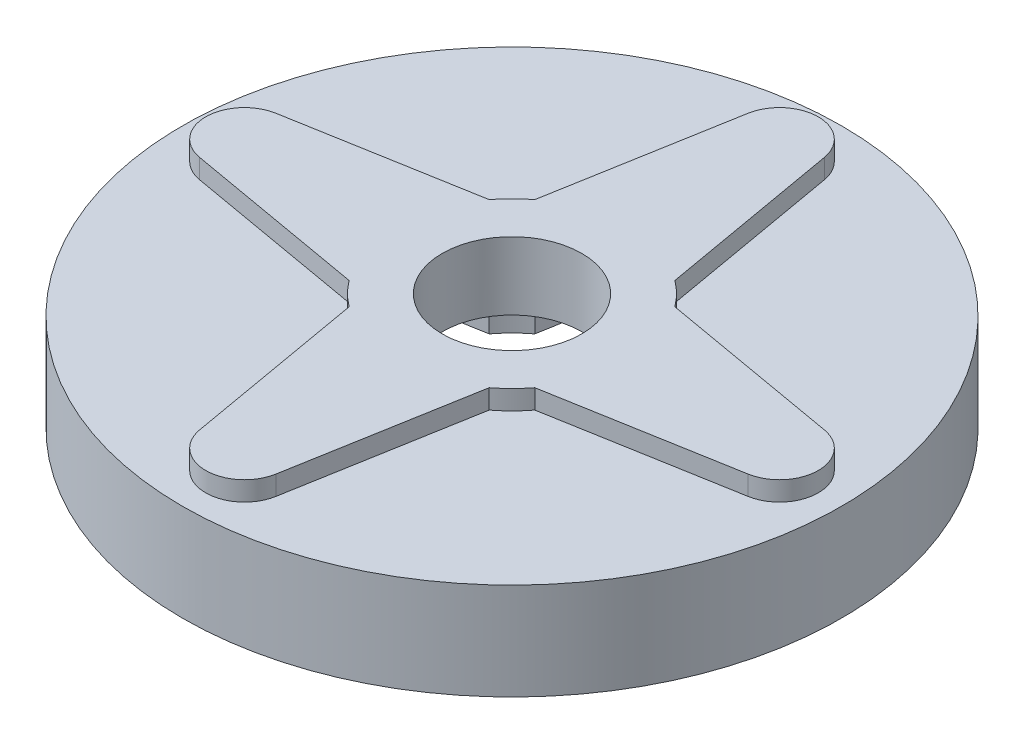
ISO-10303-21;
HEADER;
FILE_DESCRIPTION(('STEP AP214'),'2;1');
FILE_NAME('part.step','',(''),(''),'','','');
FILE_SCHEMA(('AUTOMOTIVE_DESIGN { 1 0 10303 214 1 1 1 1 }'));
ENDSEC;
DATA;
#1=APPLICATION_CONTEXT('core data for automotive mechanical design processes');
#2=APPLICATION_PROTOCOL_DEFINITION('international standard','automotive_design',2000,#1);
#3=PRODUCT_CONTEXT('',#1,'mechanical');
#4=PRODUCT('Part','Part','',(#3));
#5=PRODUCT_RELATED_PRODUCT_CATEGORY('part','',(#4));
#6=PRODUCT_DEFINITION_FORMATION('','',#4);
#7=PRODUCT_DEFINITION_CONTEXT('part definition',#1,'design');
#8=PRODUCT_DEFINITION('design','',#6,#7);
#9=PRODUCT_DEFINITION_SHAPE('','',#8);
#10=(LENGTH_UNIT() NAMED_UNIT(*) SI_UNIT(.MILLI.,.METRE.));
#11=(NAMED_UNIT(*) PLANE_ANGLE_UNIT() SI_UNIT($,.RADIAN.));
#12=(NAMED_UNIT(*) SI_UNIT($,.STERADIAN.) SOLID_ANGLE_UNIT());
#13=UNCERTAINTY_MEASURE_WITH_UNIT(LENGTH_MEASURE(1.E-05),#10,'distance_accuracy_value','');
#14=(GEOMETRIC_REPRESENTATION_CONTEXT(3) GLOBAL_UNCERTAINTY_ASSIGNED_CONTEXT((#13)) GLOBAL_UNIT_ASSIGNED_CONTEXT((#10,
#11,#12)) REPRESENTATION_CONTEXT('',''));
#15=CARTESIAN_POINT('',(0.,0.,0.));
#16=DIRECTION('',(0.,0.,1.));
#17=DIRECTION('',(1.,0.,0.));
#18=AXIS2_PLACEMENT_3D('',#15,#16,#17);
#19=CARTESIAN_POINT('',(0.,0.,0.));
#20=DIRECTION('',(0.,1.,0.));
#21=DIRECTION('',(0.,0.,1.));
#22=AXIS2_PLACEMENT_3D('',#19,#20,#21);
#23=PLANE('',#22);
#24=CARTESIAN_POINT('',(0.,0.,0.));
#25=DIRECTION('',(0.,1.,0.));
#26=DIRECTION('',(0.,0.,1.));
#27=AXIS2_PLACEMENT_3D('',#24,#25,#26);
#28=CIRCLE('',#27,21.59);
#29=CARTESIAN_POINT('',(0.,0.,21.59));
#30=VERTEX_POINT('',#29);
#31=EDGE_CURVE('E38',#30,#30,#28,.T.);
#32=ORIENTED_EDGE('',*,*,#31,.F.);
#33=EDGE_LOOP('',(#32));
#34=FACE_BOUND('',#33,.T.);
#35=DIRECTION('',(-0.172920710694254,0.,0.98493574806329));
#36=VECTOR('',#35,1.);
#37=CARTESIAN_POINT('',(-5.48669132761631,0.,-0.963273559312847));
#38=LINE('',#37,#36);
#39=CARTESIAN_POINT('',(-2.50173680008076,0.,-17.9652186051634));
#40=VERTEX_POINT('',#39);
#41=CARTESIAN_POINT('',(-4.58762464598258,0.,-6.08425016806288));
#42=VERTEX_POINT('',#41);
#43=EDGE_CURVE('E57',#40,#42,#38,.T.);
#44=ORIENTED_EDGE('',*,*,#43,.T.);
#45=CARTESIAN_POINT('',(0.,0.,0.));
#46=DIRECTION('',(0.,-1.,0.));
#47=DIRECTION('',(0.,0.,-1.));
#48=AXIS2_PLACEMENT_3D('',#45,#46,#47);
#49=CIRCLE('',#48,7.62);
#50=CARTESIAN_POINT('',(-6.08425016806289,0.,-4.58762464598257));
#51=VERTEX_POINT('',#50);
#52=EDGE_CURVE('E373',#51,#42,#49,.T.);
#53=ORIENTED_EDGE('',*,*,#52,.F.);
#54=DIRECTION('',(-0.98493574806329,0.,0.172920710694255));
#55=VECTOR('',#54,1.);
#56=CARTESIAN_POINT('',(-0.963273559312881,0.,-5.48669132761631));
#57=LINE('',#56,#55);
#58=CARTESIAN_POINT('',(-17.9652186051634,0.,-2.50173680008077));
#59=VERTEX_POINT('',#58);
#60=EDGE_CURVE('E445',#51,#59,#57,.T.);
#61=ORIENTED_EDGE('',*,*,#60,.T.);
#62=CARTESIAN_POINT('',(-17.526,0.,0.));
#63=DIRECTION('',(0.,-1.,0.));
#64=DIRECTION('',(0.,0.,-1.));
#65=AXIS2_PLACEMENT_3D('',#62,#63,#64);
#66=CIRCLE('',#65,2.54);
#67=CARTESIAN_POINT('',(-17.9652186051634,0.,2.50173680008076));
#68=VERTEX_POINT('',#67);
#69=EDGE_CURVE('E442',#68,#59,#66,.T.);
#70=ORIENTED_EDGE('',*,*,#69,.F.);
#71=DIRECTION('',(0.98493574806329,0.,0.172920710694255));
#72=VECTOR('',#71,1.);
#73=CARTESIAN_POINT('',(-0.96327355931288,0.,5.48669132761632));
#74=LINE('',#73,#72);
#75=CARTESIAN_POINT('',(-6.08425016806289,0.,4.58762464598263));
#76=VERTEX_POINT('',#75);
#77=EDGE_CURVE('E439',#68,#76,#74,.T.);
#78=ORIENTED_EDGE('',*,*,#77,.T.);
#79=CARTESIAN_POINT('',(-4.58762464598258,0.,6.0842501680629));
#80=VERTEX_POINT('',#79);
#81=EDGE_CURVE('E438',#80,#76,#49,.T.);
#82=ORIENTED_EDGE('',*,*,#81,.F.);
#83=DIRECTION('',(0.172920710694255,0.,0.98493574806329));
#84=VECTOR('',#83,1.);
#85=CARTESIAN_POINT('',(-5.48669132761631,0.,0.963273559312874));
#86=LINE('',#85,#84);
#87=CARTESIAN_POINT('',(-2.50173680008076,0.,17.9652186051634));
#88=VERTEX_POINT('',#87);
#89=EDGE_CURVE('E435',#80,#88,#86,.T.);
#90=ORIENTED_EDGE('',*,*,#89,.T.);
#91=CARTESIAN_POINT('',(0.,0.,17.526));
#92=DIRECTION('',(0.,-1.,0.));
#93=DIRECTION('',(0.,0.,-1.));
#94=AXIS2_PLACEMENT_3D('',#91,#92,#93);
#95=CIRCLE('',#94,2.54000000000001);
#96=CARTESIAN_POINT('',(2.50173680008076,0.,17.9652186051634));
#97=VERTEX_POINT('',#96);
#98=EDGE_CURVE('E432',#97,#88,#95,.T.);
#99=ORIENTED_EDGE('',*,*,#98,.F.);
#100=DIRECTION('',(0.172920710694254,0.,-0.98493574806329));
#101=VECTOR('',#100,1.);
#102=CARTESIAN_POINT('',(5.48669132761631,0.,0.963273559312874));
#103=LINE('',#102,#101);
#104=CARTESIAN_POINT('',(4.58762464598257,0.,6.08425016806292));
#105=VERTEX_POINT('',#104);
#106=EDGE_CURVE('E429',#97,#105,#103,.T.);
#107=ORIENTED_EDGE('',*,*,#106,.T.);
#108=CARTESIAN_POINT('',(6.08425016806289,0.,4.58762464598252));
#109=VERTEX_POINT('',#108);
#110=EDGE_CURVE('E420',#109,#105,#49,.T.);
#111=ORIENTED_EDGE('',*,*,#110,.F.);
#112=DIRECTION('',(0.984935748063291,0.,-0.172920710694254));
#113=VECTOR('',#112,1.);
#114=CARTESIAN_POINT('',(0.963273559312871,0.,5.48669132761632));
#115=LINE('',#114,#113);
#116=CARTESIAN_POINT('',(17.9652186051634,0.,2.50173680008076));
#117=VERTEX_POINT('',#116);
#118=EDGE_CURVE('E426',#109,#117,#115,.T.);
#119=ORIENTED_EDGE('',*,*,#118,.T.);
#120=CARTESIAN_POINT('',(17.526,0.,0.));
#121=DIRECTION('',(0.,-1.,0.));
#122=DIRECTION('',(0.,0.,-1.));
#123=AXIS2_PLACEMENT_3D('',#120,#121,#122);
#124=CIRCLE('',#123,2.54);
#125=CARTESIAN_POINT('',(17.9652186051634,0.,-2.50173680008076));
#126=VERTEX_POINT('',#125);
#127=EDGE_CURVE('E423',#126,#117,#124,.T.);
#128=ORIENTED_EDGE('',*,*,#127,.F.);
#129=DIRECTION('',(-0.984935748063291,0.,-0.172920710694254));
#130=VECTOR('',#129,1.);
#131=CARTESIAN_POINT('',(0.963273559312869,0.,-5.48669132761628));
#132=LINE('',#131,#130);
#133=CARTESIAN_POINT('',(6.08425016806289,0.,-4.58762464598257));
#134=VERTEX_POINT('',#133);
#135=EDGE_CURVE('E419',#126,#134,#132,.T.);
#136=ORIENTED_EDGE('',*,*,#135,.T.);
#137=CARTESIAN_POINT('',(4.58762464598257,0.,-6.08425016806287));
#138=VERTEX_POINT('',#137);
#139=EDGE_CURVE('E416',#138,#134,#49,.T.);
#140=ORIENTED_EDGE('',*,*,#139,.F.);
#141=DIRECTION('',(-0.172920710694255,0.,-0.98493574806329));
#142=VECTOR('',#141,1.);
#143=CARTESIAN_POINT('',(5.48669132761631,0.,-0.963273559312902));
#144=LINE('',#143,#142);
#145=CARTESIAN_POINT('',(2.50173680008076,0.,-17.9652186051634));
#146=VERTEX_POINT('',#145);
#147=EDGE_CURVE('E413',#138,#146,#144,.T.);
#148=ORIENTED_EDGE('',*,*,#147,.T.);
#149=CARTESIAN_POINT('',(0.,0.,-17.526));
#150=DIRECTION('',(0.,-1.,0.));
#151=DIRECTION('',(0.,0.,-1.));
#152=AXIS2_PLACEMENT_3D('',#149,#150,#151);
#153=CIRCLE('',#152,2.54);
#154=EDGE_CURVE('E410',#40,#146,#153,.T.);
#155=ORIENTED_EDGE('',*,*,#154,.F.);
#156=EDGE_LOOP('',(#44,#53,#61,#70,#78,#82,#90,#99,#107,#111,#119,#128,#136,#140,#148,#155));
#157=FACE_BOUND('',#156,.T.);
#158=ADVANCED_FACE('F34',(#34,#157),#23,.F.);
#159=CARTESIAN_POINT('',(0.,6.35,0.));
#160=DIRECTION('',(0.,-1.,0.));
#161=DIRECTION('',(0.,0.,-1.));
#162=AXIS2_PLACEMENT_3D('',#159,#160,#161);
#163=CYLINDRICAL_SURFACE('',#162,4.572);
#164=CARTESIAN_POINT('',(0.,3.175,0.));
#165=DIRECTION('',(0.,-1.,0.));
#166=DIRECTION('',(0.,0.,-1.));
#167=AXIS2_PLACEMENT_3D('',#164,#165,#166);
#168=CIRCLE('',#167,4.572);
#169=CARTESIAN_POINT('',(0.,3.175,-4.572));
#170=VERTEX_POINT('',#169);
#171=EDGE_CURVE('E405',#170,#170,#168,.F.);
#172=ORIENTED_EDGE('',*,*,#171,.F.);
#173=EDGE_LOOP('',(#172));
#174=FACE_BOUND('',#173,.T.);
#175=CARTESIAN_POINT('',(0.,7.62,0.));
#176=DIRECTION('',(0.,1.,0.));
#177=DIRECTION('',(0.,0.,1.));
#178=AXIS2_PLACEMENT_3D('',#175,#176,#177);
#179=CIRCLE('',#178,4.572);
#180=CARTESIAN_POINT('',(0.,7.62,4.572));
#181=VERTEX_POINT('',#180);
#182=EDGE_CURVE('E305',#181,#181,#179,.F.);
#183=ORIENTED_EDGE('',*,*,#182,.F.);
#184=EDGE_LOOP('',(#183));
#185=FACE_BOUND('',#184,.T.);
#186=ADVANCED_FACE('F554',(#174,#185),#163,.F.);
#187=CARTESIAN_POINT('',(0.,6.35,0.));
#188=DIRECTION('',(0.,-1.,0.));
#189=DIRECTION('',(0.,0.,-1.));
#190=AXIS2_PLACEMENT_3D('',#187,#188,#189);
#191=CYLINDRICAL_SURFACE('',#190,21.59);
#192=CARTESIAN_POINT('',(0.,6.35,0.));
#193=DIRECTION('',(0.,1.,0.));
#194=DIRECTION('',(0.,0.,1.));
#195=AXIS2_PLACEMENT_3D('',#192,#193,#194);
#196=CIRCLE('',#195,21.59);
#197=CARTESIAN_POINT('',(0.,6.35,21.59));
#198=VERTEX_POINT('',#197);
#199=EDGE_CURVE('E11',#198,#198,#196,.T.);
#200=ORIENTED_EDGE('',*,*,#199,.F.);
#201=EDGE_LOOP('',(#200));
#202=FACE_BOUND('',#201,.T.);
#203=ORIENTED_EDGE('',*,*,#31,.T.);
#204=EDGE_LOOP('',(#203));
#205=FACE_BOUND('',#204,.T.);
#206=ADVANCED_FACE('F36',(#202,#205),#191,.T.);
#207=CARTESIAN_POINT('',(0.,6.35,0.));
#208=DIRECTION('',(0.,1.,0.));
#209=DIRECTION('',(0.,0.,1.));
#210=AXIS2_PLACEMENT_3D('',#207,#208,#209);
#211=PLANE('',#210);
#212=DIRECTION('',(0.172920710694256,0.,0.98493574806329));
#213=VECTOR('',#212,1.);
#214=CARTESIAN_POINT('',(5.48669132761631,6.35,-0.963273559312902));
#215=LINE('',#214,#213);
#216=CARTESIAN_POINT('',(2.50173680008076,6.35,-17.9652186051634));
#217=VERTEX_POINT('',#216);
#218=CARTESIAN_POINT('',(4.58762464598257,6.35,-6.08425016806287));
#219=VERTEX_POINT('',#218);
#220=EDGE_CURVE('E249',#217,#219,#215,.T.);
#221=ORIENTED_EDGE('',*,*,#220,.T.);
#222=CARTESIAN_POINT('',(0.,6.35,0.));
#223=DIRECTION('',(0.,1.,0.));
#224=DIRECTION('',(0.,0.,1.));
#225=AXIS2_PLACEMENT_3D('',#222,#223,#224);
#226=CIRCLE('',#225,7.62);
#227=CARTESIAN_POINT('',(6.08425016806289,6.35,-4.58762464598256));
#228=VERTEX_POINT('',#227);
#229=EDGE_CURVE('E269',#228,#219,#226,.T.);
#230=ORIENTED_EDGE('',*,*,#229,.F.);
#231=DIRECTION('',(0.984935748063291,0.,0.172920710694254));
#232=VECTOR('',#231,1.);
#233=CARTESIAN_POINT('',(0.963273559312869,6.35,-5.48669132761628));
#234=LINE('',#233,#232);
#235=CARTESIAN_POINT('',(17.9652186051634,6.35,-2.50173680008076));
#236=VERTEX_POINT('',#235);
#237=EDGE_CURVE('E49',#228,#236,#234,.T.);
#238=ORIENTED_EDGE('',*,*,#237,.T.);
#239=CARTESIAN_POINT('',(17.526,6.35,0.));
#240=DIRECTION('',(0.,1.,0.));
#241=DIRECTION('',(0.,0.,1.));
#242=AXIS2_PLACEMENT_3D('',#239,#240,#241);
#243=CIRCLE('',#242,2.54);
#244=CARTESIAN_POINT('',(17.9652186051634,6.35,2.50173680008076));
#245=VERTEX_POINT('',#244);
#246=EDGE_CURVE('E338',#245,#236,#243,.T.);
#247=ORIENTED_EDGE('',*,*,#246,.F.);
#248=DIRECTION('',(-0.984935748063291,0.,0.172920710694254));
#249=VECTOR('',#248,1.);
#250=CARTESIAN_POINT('',(0.963273559312869,6.35,5.48669132761632));
#251=LINE('',#250,#249);
#252=CARTESIAN_POINT('',(6.08425016806289,6.35,4.58762464598252));
#253=VERTEX_POINT('',#252);
#254=EDGE_CURVE('E335',#245,#253,#251,.T.);
#255=ORIENTED_EDGE('',*,*,#254,.T.);
#256=CARTESIAN_POINT('',(4.58762464598257,6.35,6.08425016806292));
#257=VERTEX_POINT('',#256);
#258=EDGE_CURVE('E273',#257,#253,#226,.T.);
#259=ORIENTED_EDGE('',*,*,#258,.F.);
#260=DIRECTION('',(-0.172920710694255,0.,0.98493574806329));
#261=VECTOR('',#260,1.);
#262=CARTESIAN_POINT('',(5.48669132761631,6.35,0.963273559312888));
#263=LINE('',#262,#261);
#264=CARTESIAN_POINT('',(2.50173680008076,6.35,17.9652186051634));
#265=VERTEX_POINT('',#264);
#266=EDGE_CURVE('E332',#257,#265,#263,.T.);
#267=ORIENTED_EDGE('',*,*,#266,.T.);
#268=CARTESIAN_POINT('',(0.,6.35,17.526));
#269=DIRECTION('',(0.,1.,0.));
#270=DIRECTION('',(0.,0.,1.));
#271=AXIS2_PLACEMENT_3D('',#268,#269,#270);
#272=CIRCLE('',#271,2.54000000000001);
#273=CARTESIAN_POINT('',(-2.50173680008076,6.35,17.9652186051634));
#274=VERTEX_POINT('',#273);
#275=EDGE_CURVE('E329',#274,#265,#272,.T.);
#276=ORIENTED_EDGE('',*,*,#275,.F.);
#277=DIRECTION('',(-0.172920710694256,0.,-0.98493574806329));
#278=VECTOR('',#277,1.);
#279=CARTESIAN_POINT('',(-5.48669132761632,6.35,0.963273559312861));
#280=LINE('',#279,#278);
#281=CARTESIAN_POINT('',(-4.58762464598257,6.35,6.0842501680629));
#282=VERTEX_POINT('',#281);
#283=EDGE_CURVE('E326',#274,#282,#280,.T.);
#284=ORIENTED_EDGE('',*,*,#283,.T.);
#285=CARTESIAN_POINT('',(-6.08425016806288,6.35,4.58762464598263));
#286=VERTEX_POINT('',#285);
#287=EDGE_CURVE('E317',#286,#282,#226,.T.);
#288=ORIENTED_EDGE('',*,*,#287,.F.);
#289=DIRECTION('',(-0.98493574806329,0.,-0.172920710694255));
#290=VECTOR('',#289,1.);
#291=CARTESIAN_POINT('',(-0.963273559312878,6.35,5.48669132761632));
#292=LINE('',#291,#290);
#293=CARTESIAN_POINT('',(-17.9652186051634,6.35,2.50173680008076));
#294=VERTEX_POINT('',#293);
#295=EDGE_CURVE('E323',#286,#294,#292,.T.);
#296=ORIENTED_EDGE('',*,*,#295,.T.);
#297=CARTESIAN_POINT('',(-17.526,6.35,0.));
#298=DIRECTION('',(0.,1.,0.));
#299=DIRECTION('',(0.,0.,1.));
#300=AXIS2_PLACEMENT_3D('',#297,#298,#299);
#301=CIRCLE('',#300,2.54);
#302=CARTESIAN_POINT('',(-17.9652186051634,6.35,-2.50173680008078));
#303=VERTEX_POINT('',#302);
#304=EDGE_CURVE('E320',#303,#294,#301,.T.);
#305=ORIENTED_EDGE('',*,*,#304,.F.);
#306=DIRECTION('',(0.98493574806329,0.,-0.172920710694254));
#307=VECTOR('',#306,1.);
#308=CARTESIAN_POINT('',(-0.963273559312878,6.35,-5.48669132761631));
#309=LINE('',#308,#307);
#310=CARTESIAN_POINT('',(-6.08425016806288,6.35,-4.58762464598257));
#311=VERTEX_POINT('',#310);
#312=EDGE_CURVE('E316',#303,#311,#309,.T.);
#313=ORIENTED_EDGE('',*,*,#312,.T.);
#314=CARTESIAN_POINT('',(-4.58762464598257,6.35,-6.08425016806288));
#315=VERTEX_POINT('',#314);
#316=EDGE_CURVE('E274',#315,#311,#226,.T.);
#317=ORIENTED_EDGE('',*,*,#316,.F.);
#318=DIRECTION('',(0.172920710694255,0.,-0.98493574806329));
#319=VECTOR('',#318,1.);
#320=CARTESIAN_POINT('',(-5.48669132761631,6.35,-0.963273559312861));
#321=LINE('',#320,#319);
#322=CARTESIAN_POINT('',(-2.50173680008076,6.35,-17.9652186051634));
#323=VERTEX_POINT('',#322);
#324=EDGE_CURVE('E312',#315,#323,#321,.T.);
#325=ORIENTED_EDGE('',*,*,#324,.T.);
#326=CARTESIAN_POINT('',(0.,6.35,-17.526));
#327=DIRECTION('',(0.,1.,0.));
#328=DIRECTION('',(0.,0.,1.));
#329=AXIS2_PLACEMENT_3D('',#326,#327,#328);
#330=CIRCLE('',#329,2.54);
#331=EDGE_CURVE('E310',#217,#323,#330,.T.);
#332=ORIENTED_EDGE('',*,*,#331,.F.);
#333=EDGE_LOOP('',(#221,#230,#238,#247,#255,#259,#267,#276,#284,#288,#296,#305,#313,#317,#325,#332));
#334=FACE_BOUND('',#333,.T.);
#335=ORIENTED_EDGE('',*,*,#199,.T.);
#336=EDGE_LOOP('',(#335));
#337=FACE_BOUND('',#336,.T.);
#338=ADVANCED_FACE('F563',(#334,#337),#211,.T.);
#339=CARTESIAN_POINT('',(-5.48669132761631,3.175,-0.963273559312847));
#340=DIRECTION('',(0.98493574806329,0.,0.172920710694254));
#341=DIRECTION('',(0.172920710694254,0.,-0.98493574806329));
#342=AXIS2_PLACEMENT_3D('',#339,#340,#341);
#343=PLANE('',#342);
#344=ORIENTED_EDGE('',*,*,#43,.F.);
#345=DIRECTION('',(0.,-1.,0.));
#346=VECTOR('',#345,1.);
#347=CARTESIAN_POINT('',(-2.50173680008076,3.175,-17.9652186051634));
#348=LINE('',#347,#346);
#349=CARTESIAN_POINT('',(-2.50173680008076,3.175,-17.9652186051634));
#350=VERTEX_POINT('',#349);
#351=EDGE_CURVE('E408',#350,#40,#348,.T.);
#352=ORIENTED_EDGE('',*,*,#351,.F.);
#353=DIRECTION('',(-0.172920710694254,0.,0.98493574806329));
#354=VECTOR('',#353,1.);
#355=CARTESIAN_POINT('',(-5.48669132761631,3.175,-0.963273559312847));
#356=LINE('',#355,#354);
#357=CARTESIAN_POINT('',(-4.58762464598257,3.175,-6.08425016806288));
#358=VERTEX_POINT('',#357);
#359=EDGE_CURVE('E370',#350,#358,#356,.T.);
#360=ORIENTED_EDGE('',*,*,#359,.T.);
#361=DIRECTION('',(0.,-1.,0.));
#362=VECTOR('',#361,1.);
#363=CARTESIAN_POINT('',(-4.58762464598257,3.175,-6.08425016806288));
#364=LINE('',#363,#362);
#365=EDGE_CURVE('E448',#358,#42,#364,.T.);
#366=ORIENTED_EDGE('',*,*,#365,.T.);
#367=EDGE_LOOP('',(#344,#352,#360,#366));
#368=FACE_BOUND('',#367,.T.);
#369=ADVANCED_FACE('F499',(#368),#343,.T.);
#370=CARTESIAN_POINT('',(0.,3.175,0.));
#371=DIRECTION('',(0.,-1.,0.));
#372=DIRECTION('',(0.,0.,-1.));
#373=AXIS2_PLACEMENT_3D('',#370,#371,#372);
#374=CYLINDRICAL_SURFACE('',#373,7.62);
#375=ORIENTED_EDGE('',*,*,#52,.T.);
#376=ORIENTED_EDGE('',*,*,#365,.F.);
#377=CARTESIAN_POINT('',(0.,3.175,0.));
#378=DIRECTION('',(0.,-1.,0.));
#379=DIRECTION('',(0.,0.,-1.));
#380=AXIS2_PLACEMENT_3D('',#377,#378,#379);
#381=CIRCLE('',#380,7.62);
#382=CARTESIAN_POINT('',(-6.08425016806288,3.175,-4.58762464598257));
#383=VERTEX_POINT('',#382);
#384=EDGE_CURVE('E382',#383,#358,#381,.T.);
#385=ORIENTED_EDGE('',*,*,#384,.F.);
#386=DIRECTION('',(0.,-1.,0.));
#387=VECTOR('',#386,1.);
#388=CARTESIAN_POINT('',(-6.08425016806288,3.175,-4.58762464598257));
#389=LINE('',#388,#387);
#390=EDGE_CURVE('E450',#383,#51,#389,.T.);
#391=ORIENTED_EDGE('',*,*,#390,.T.);
#392=EDGE_LOOP('',(#375,#376,#385,#391));
#393=FACE_BOUND('',#392,.T.);
#394=ADVANCED_FACE('F502',(#393),#374,.F.);
#395=CARTESIAN_POINT('',(-0.96327355931288,3.175,-5.48669132761631));
#396=DIRECTION('',(0.172920710694255,0.,0.98493574806329));
#397=DIRECTION('',(0.98493574806329,0.,-0.172920710694255));
#398=AXIS2_PLACEMENT_3D('',#395,#396,#397);
#399=PLANE('',#398);
#400=ORIENTED_EDGE('',*,*,#60,.F.);
#401=ORIENTED_EDGE('',*,*,#390,.F.);
#402=DIRECTION('',(-0.98493574806329,0.,0.172920710694255));
#403=VECTOR('',#402,1.);
#404=CARTESIAN_POINT('',(-0.96327355931288,3.175,-5.48669132761631));
#405=LINE('',#404,#403);
#406=CARTESIAN_POINT('',(-17.9652186051634,3.175,-2.50173680008077));
#407=VERTEX_POINT('',#406);
#408=EDGE_CURVE('E403',#383,#407,#405,.T.);
#409=ORIENTED_EDGE('',*,*,#408,.T.);
#410=DIRECTION('',(0.,-1.,0.));
#411=VECTOR('',#410,1.);
#412=CARTESIAN_POINT('',(-17.9652186051634,3.175,-2.50173680008077));
#413=LINE('',#412,#411);
#414=EDGE_CURVE('E452',#407,#59,#413,.T.);
#415=ORIENTED_EDGE('',*,*,#414,.T.);
#416=EDGE_LOOP('',(#400,#401,#409,#415));
#417=FACE_BOUND('',#416,.T.);
#418=ADVANCED_FACE('F543',(#417),#399,.T.);
#419=CARTESIAN_POINT('',(-17.526,3.175,0.));
#420=DIRECTION('',(0.,-1.,0.));
#421=DIRECTION('',(0.,0.,-1.));
#422=AXIS2_PLACEMENT_3D('',#419,#420,#421);
#423=CYLINDRICAL_SURFACE('',#422,2.54);
#424=ORIENTED_EDGE('',*,*,#69,.T.);
#425=ORIENTED_EDGE('',*,*,#414,.F.);
#426=CARTESIAN_POINT('',(-17.526,3.175,0.));
#427=DIRECTION('',(0.,-1.,0.));
#428=DIRECTION('',(0.,0.,-1.));
#429=AXIS2_PLACEMENT_3D('',#426,#427,#428);
#430=CIRCLE('',#429,2.54);
#431=CARTESIAN_POINT('',(-17.9652186051634,3.175,2.50173680008076));
#432=VERTEX_POINT('',#431);
#433=EDGE_CURVE('E400',#432,#407,#430,.T.);
#434=ORIENTED_EDGE('',*,*,#433,.F.);
#435=DIRECTION('',(0.,-1.,0.));
#436=VECTOR('',#435,1.);
#437=CARTESIAN_POINT('',(-17.9652186051634,3.175,2.50173680008076));
#438=LINE('',#437,#436);
#439=EDGE_CURVE('E454',#432,#68,#438,.T.);
#440=ORIENTED_EDGE('',*,*,#439,.T.);
#441=EDGE_LOOP('',(#424,#425,#434,#440));
#442=FACE_BOUND('',#441,.T.);
#443=ADVANCED_FACE('F541',(#442),#423,.F.);
#444=CARTESIAN_POINT('',(-0.963273559312878,3.175,5.48669132761632));
#445=DIRECTION('',(0.172920710694255,0.,-0.98493574806329));
#446=DIRECTION('',(-0.98493574806329,0.,-0.172920710694255));
#447=AXIS2_PLACEMENT_3D('',#444,#445,#446);
#448=PLANE('',#447);
#449=ORIENTED_EDGE('',*,*,#77,.F.);
#450=ORIENTED_EDGE('',*,*,#439,.F.);
#451=DIRECTION('',(0.98493574806329,0.,0.172920710694255));
#452=VECTOR('',#451,1.);
#453=CARTESIAN_POINT('',(-0.963273559312878,3.175,5.48669132761632));
#454=LINE('',#453,#452);
#455=CARTESIAN_POINT('',(-6.08425016806288,3.175,4.58762464598263));
#456=VERTEX_POINT('',#455);
#457=EDGE_CURVE('E398',#432,#456,#454,.T.);
#458=ORIENTED_EDGE('',*,*,#457,.T.);
#459=DIRECTION('',(0.,-1.,0.));
#460=VECTOR('',#459,1.);
#461=CARTESIAN_POINT('',(-6.08425016806288,3.175,4.58762464598263));
#462=LINE('',#461,#460);
#463=EDGE_CURVE('E456',#456,#76,#462,.T.);
#464=ORIENTED_EDGE('',*,*,#463,.T.);
#465=EDGE_LOOP('',(#449,#450,#458,#464));
#466=FACE_BOUND('',#465,.T.);
#467=ADVANCED_FACE('F536',(#466),#448,.T.);
#468=ORIENTED_EDGE('',*,*,#81,.T.);
#469=ORIENTED_EDGE('',*,*,#463,.F.);
#470=CARTESIAN_POINT('',(-4.58762464598257,3.175,6.0842501680629));
#471=VERTEX_POINT('',#470);
#472=EDGE_CURVE('E397',#471,#456,#381,.T.);
#473=ORIENTED_EDGE('',*,*,#472,.F.);
#474=DIRECTION('',(0.,-1.,0.));
#475=VECTOR('',#474,1.);
#476=CARTESIAN_POINT('',(-4.58762464598257,3.175,6.0842501680629));
#477=LINE('',#476,#475);
#478=EDGE_CURVE('E458',#471,#80,#477,.T.);
#479=ORIENTED_EDGE('',*,*,#478,.T.);
#480=EDGE_LOOP('',(#468,#469,#473,#479));
#481=FACE_BOUND('',#480,.T.);
#482=ADVANCED_FACE('F533',(#481),#374,.F.);
#483=CARTESIAN_POINT('',(-5.48669132761631,3.175,0.963273559312874));
#484=DIRECTION('',(0.98493574806329,0.,-0.172920710694255));
#485=DIRECTION('',(-0.172920710694255,0.,-0.98493574806329));
#486=AXIS2_PLACEMENT_3D('',#483,#484,#485);
#487=PLANE('',#486);
#488=ORIENTED_EDGE('',*,*,#89,.F.);
#489=ORIENTED_EDGE('',*,*,#478,.F.);
#490=DIRECTION('',(0.172920710694255,0.,0.98493574806329));
#491=VECTOR('',#490,1.);
#492=CARTESIAN_POINT('',(-5.48669132761631,3.175,0.963273559312874));
#493=LINE('',#492,#491);
#494=CARTESIAN_POINT('',(-2.50173680008076,3.175,17.9652186051634));
#495=VERTEX_POINT('',#494);
#496=EDGE_CURVE('E395',#471,#495,#493,.T.);
#497=ORIENTED_EDGE('',*,*,#496,.T.);
#498=DIRECTION('',(0.,-1.,0.));
#499=VECTOR('',#498,1.);
#500=CARTESIAN_POINT('',(-2.50173680008076,3.175,17.9652186051634));
#501=LINE('',#500,#499);
#502=EDGE_CURVE('E460',#495,#88,#501,.T.);
#503=ORIENTED_EDGE('',*,*,#502,.T.);
#504=EDGE_LOOP('',(#488,#489,#497,#503));
#505=FACE_BOUND('',#504,.T.);
#506=ADVANCED_FACE('F529',(#505),#487,.T.);
#507=CARTESIAN_POINT('',(0.,3.175,17.526));
#508=DIRECTION('',(0.,-1.,0.));
#509=DIRECTION('',(0.,0.,-1.));
#510=AXIS2_PLACEMENT_3D('',#507,#508,#509);
#511=CYLINDRICAL_SURFACE('',#510,2.54000000000001);
#512=ORIENTED_EDGE('',*,*,#98,.T.);
#513=ORIENTED_EDGE('',*,*,#502,.F.);
#514=CARTESIAN_POINT('',(0.,3.175,17.526));
#515=DIRECTION('',(0.,-1.,0.));
#516=DIRECTION('',(0.,0.,-1.));
#517=AXIS2_PLACEMENT_3D('',#514,#515,#516);
#518=CIRCLE('',#517,2.54000000000001);
#519=CARTESIAN_POINT('',(2.50173680008076,3.175,17.9652186051634));
#520=VERTEX_POINT('',#519);
#521=EDGE_CURVE('E392',#520,#495,#518,.T.);
#522=ORIENTED_EDGE('',*,*,#521,.F.);
#523=DIRECTION('',(0.,-1.,0.));
#524=VECTOR('',#523,1.);
#525=CARTESIAN_POINT('',(2.50173680008076,3.175,17.9652186051634));
#526=LINE('',#525,#524);
#527=EDGE_CURVE('E462',#520,#97,#526,.T.);
#528=ORIENTED_EDGE('',*,*,#527,.T.);
#529=EDGE_LOOP('',(#512,#513,#522,#528));
#530=FACE_BOUND('',#529,.T.);
#531=ADVANCED_FACE('F526',(#530),#511,.F.);
#532=CARTESIAN_POINT('',(5.48669132761631,3.175,0.963273559312874));
#533=DIRECTION('',(-0.98493574806329,0.,-0.172920710694254));
#534=DIRECTION('',(-0.172920710694254,0.,0.98493574806329));
#535=AXIS2_PLACEMENT_3D('',#532,#533,#534);
#536=PLANE('',#535);
#537=ORIENTED_EDGE('',*,*,#106,.F.);
#538=ORIENTED_EDGE('',*,*,#527,.F.);
#539=DIRECTION('',(0.172920710694254,0.,-0.98493574806329));
#540=VECTOR('',#539,1.);
#541=CARTESIAN_POINT('',(5.48669132761631,3.175,0.963273559312874));
#542=LINE('',#541,#540);
#543=CARTESIAN_POINT('',(4.58762464598257,3.175,6.08425016806292));
#544=VERTEX_POINT('',#543);
#545=EDGE_CURVE('E390',#520,#544,#542,.T.);
#546=ORIENTED_EDGE('',*,*,#545,.T.);
#547=DIRECTION('',(0.,-1.,0.));
#548=VECTOR('',#547,1.);
#549=CARTESIAN_POINT('',(4.58762464598257,3.175,6.08425016806292));
#550=LINE('',#549,#548);
#551=EDGE_CURVE('E464',#544,#105,#550,.T.);
#552=ORIENTED_EDGE('',*,*,#551,.T.);
#553=EDGE_LOOP('',(#537,#538,#546,#552));
#554=FACE_BOUND('',#553,.T.);
#555=ADVANCED_FACE('F519',(#554),#536,.T.);
#556=ORIENTED_EDGE('',*,*,#110,.T.);
#557=ORIENTED_EDGE('',*,*,#551,.F.);
#558=CARTESIAN_POINT('',(6.08425016806289,3.175,4.58762464598252));
#559=VERTEX_POINT('',#558);
#560=EDGE_CURVE('E383',#559,#544,#381,.T.);
#561=ORIENTED_EDGE('',*,*,#560,.F.);
#562=DIRECTION('',(0.,-1.,0.));
#563=VECTOR('',#562,1.);
#564=CARTESIAN_POINT('',(6.08425016806289,3.175,4.58762464598252));
#565=LINE('',#564,#563);
#566=EDGE_CURVE('E466',#559,#109,#565,.T.);
#567=ORIENTED_EDGE('',*,*,#566,.T.);
#568=EDGE_LOOP('',(#556,#557,#561,#567));
#569=FACE_BOUND('',#568,.T.);
#570=ADVANCED_FACE('F512',(#569),#374,.F.);
#571=CARTESIAN_POINT('',(0.963273559312873,3.175,5.48669132761632));
#572=DIRECTION('',(-0.172920710694254,0.,-0.984935748063291));
#573=DIRECTION('',(-0.984935748063291,0.,0.172920710694254));
#574=AXIS2_PLACEMENT_3D('',#571,#572,#573);
#575=PLANE('',#574);
#576=ORIENTED_EDGE('',*,*,#118,.F.);
#577=ORIENTED_EDGE('',*,*,#566,.F.);
#578=DIRECTION('',(0.984935748063291,0.,-0.172920710694254));
#579=VECTOR('',#578,1.);
#580=CARTESIAN_POINT('',(0.963273559312873,3.175,5.48669132761632));
#581=LINE('',#580,#579);
#582=CARTESIAN_POINT('',(17.9652186051634,3.175,2.50173680008076));
#583=VERTEX_POINT('',#582);
#584=EDGE_CURVE('E388',#559,#583,#581,.T.);
#585=ORIENTED_EDGE('',*,*,#584,.T.);
#586=DIRECTION('',(0.,-1.,0.));
#587=VECTOR('',#586,1.);
#588=CARTESIAN_POINT('',(17.9652186051634,3.175,2.50173680008076));
#589=LINE('',#588,#587);
#590=EDGE_CURVE('E468',#583,#117,#589,.T.);
#591=ORIENTED_EDGE('',*,*,#590,.T.);
#592=EDGE_LOOP('',(#576,#577,#585,#591));
#593=FACE_BOUND('',#592,.T.);
#594=ADVANCED_FACE('F580',(#593),#575,.T.);
#595=CARTESIAN_POINT('',(17.526,3.175,0.));
#596=DIRECTION('',(0.,-1.,0.));
#597=DIRECTION('',(0.,0.,-1.));
#598=AXIS2_PLACEMENT_3D('',#595,#596,#597);
#599=CYLINDRICAL_SURFACE('',#598,2.54);
#600=ORIENTED_EDGE('',*,*,#127,.T.);
#601=ORIENTED_EDGE('',*,*,#590,.F.);
#602=CARTESIAN_POINT('',(17.526,3.175,0.));
#603=DIRECTION('',(0.,-1.,0.));
#604=DIRECTION('',(0.,0.,-1.));
#605=AXIS2_PLACEMENT_3D('',#602,#603,#604);
#606=CIRCLE('',#605,2.54);
#607=CARTESIAN_POINT('',(17.9652186051634,3.175,-2.50173680008076));
#608=VERTEX_POINT('',#607);
#609=EDGE_CURVE('E385',#608,#583,#606,.T.);
#610=ORIENTED_EDGE('',*,*,#609,.F.);
#611=DIRECTION('',(0.,-1.,0.));
#612=VECTOR('',#611,1.);
#613=CARTESIAN_POINT('',(17.9652186051634,3.175,-2.50173680008076));
#614=LINE('',#613,#612);
#615=EDGE_CURVE('E470',#608,#126,#614,.T.);
#616=ORIENTED_EDGE('',*,*,#615,.T.);
#617=EDGE_LOOP('',(#600,#601,#610,#616));
#618=FACE_BOUND('',#617,.T.);
#619=ADVANCED_FACE('F576',(#618),#599,.F.);
#620=CARTESIAN_POINT('',(0.963273559312871,3.175,-5.48669132761628));
#621=DIRECTION('',(-0.172920710694254,0.,0.984935748063291));
#622=DIRECTION('',(0.984935748063291,0.,0.172920710694254));
#623=AXIS2_PLACEMENT_3D('',#620,#621,#622);
#624=PLANE('',#623);
#625=ORIENTED_EDGE('',*,*,#135,.F.);
#626=ORIENTED_EDGE('',*,*,#615,.F.);
#627=DIRECTION('',(-0.984935748063291,0.,-0.172920710694254));
#628=VECTOR('',#627,1.);
#629=CARTESIAN_POINT('',(0.963273559312871,3.175,-5.48669132761628));
#630=LINE('',#629,#628);
#631=CARTESIAN_POINT('',(6.08425016806289,3.175,-4.58762464598256));
#632=VERTEX_POINT('',#631);
#633=EDGE_CURVE('E381',#608,#632,#630,.T.);
#634=ORIENTED_EDGE('',*,*,#633,.T.);
#635=DIRECTION('',(0.,-1.,0.));
#636=VECTOR('',#635,1.);
#637=CARTESIAN_POINT('',(6.08425016806289,3.175,-4.58762464598256));
#638=LINE('',#637,#636);
#639=EDGE_CURVE('E472',#632,#134,#638,.T.);
#640=ORIENTED_EDGE('',*,*,#639,.T.);
#641=EDGE_LOOP('',(#625,#626,#634,#640));
#642=FACE_BOUND('',#641,.T.);
#643=ADVANCED_FACE('F573',(#642),#624,.T.);
#644=ORIENTED_EDGE('',*,*,#139,.T.);
#645=ORIENTED_EDGE('',*,*,#639,.F.);
#646=CARTESIAN_POINT('',(4.58762464598257,3.175,-6.08425016806287));
#647=VERTEX_POINT('',#646);
#648=EDGE_CURVE('E378',#647,#632,#381,.T.);
#649=ORIENTED_EDGE('',*,*,#648,.F.);
#650=DIRECTION('',(0.,-1.,0.));
#651=VECTOR('',#650,1.);
#652=CARTESIAN_POINT('',(4.58762464598257,3.175,-6.08425016806287));
#653=LINE('',#652,#651);
#654=EDGE_CURVE('E474',#647,#138,#653,.T.);
#655=ORIENTED_EDGE('',*,*,#654,.T.);
#656=EDGE_LOOP('',(#644,#645,#649,#655));
#657=FACE_BOUND('',#656,.T.);
#658=ADVANCED_FACE('F552',(#657),#374,.F.);
#659=CARTESIAN_POINT('',(5.48669132761631,3.175,-0.963273559312902));
#660=DIRECTION('',(-0.98493574806329,0.,0.172920710694255));
#661=DIRECTION('',(0.172920710694255,0.,0.98493574806329));
#662=AXIS2_PLACEMENT_3D('',#659,#660,#661);
#663=PLANE('',#662);
#664=ORIENTED_EDGE('',*,*,#147,.F.);
#665=ORIENTED_EDGE('',*,*,#654,.F.);
#666=DIRECTION('',(-0.172920710694255,0.,-0.98493574806329));
#667=VECTOR('',#666,1.);
#668=CARTESIAN_POINT('',(5.48669132761631,3.175,-0.963273559312902));
#669=LINE('',#668,#667);
#670=CARTESIAN_POINT('',(2.50173680008076,3.175,-17.9652186051634));
#671=VERTEX_POINT('',#670);
#672=EDGE_CURVE('E376',#647,#671,#669,.T.);
#673=ORIENTED_EDGE('',*,*,#672,.T.);
#674=DIRECTION('',(0.,-1.,0.));
#675=VECTOR('',#674,1.);
#676=CARTESIAN_POINT('',(2.50173680008076,3.175,-17.9652186051634));
#677=LINE('',#676,#675);
#678=EDGE_CURVE('E476',#671,#146,#677,.T.);
#679=ORIENTED_EDGE('',*,*,#678,.T.);
#680=EDGE_LOOP('',(#664,#665,#673,#679));
#681=FACE_BOUND('',#680,.T.);
#682=ADVANCED_FACE('F489',(#681),#663,.T.);
#683=CARTESIAN_POINT('',(0.,3.175,-17.526));
#684=DIRECTION('',(0.,-1.,0.));
#685=DIRECTION('',(0.,0.,-1.));
#686=AXIS2_PLACEMENT_3D('',#683,#684,#685);
#687=CYLINDRICAL_SURFACE('',#686,2.54);
#688=ORIENTED_EDGE('',*,*,#154,.T.);
#689=ORIENTED_EDGE('',*,*,#678,.F.);
#690=CARTESIAN_POINT('',(0.,3.175,-17.526));
#691=DIRECTION('',(0.,-1.,0.));
#692=DIRECTION('',(0.,0.,-1.));
#693=AXIS2_PLACEMENT_3D('',#690,#691,#692);
#694=CIRCLE('',#693,2.54);
#695=EDGE_CURVE('E372',#350,#671,#694,.T.);
#696=ORIENTED_EDGE('',*,*,#695,.F.);
#697=ORIENTED_EDGE('',*,*,#351,.T.);
#698=EDGE_LOOP('',(#688,#689,#696,#697));
#699=FACE_BOUND('',#698,.T.);
#700=ADVANCED_FACE('F481',(#699),#687,.F.);
#701=CARTESIAN_POINT('',(0.,3.175,0.));
#702=DIRECTION('',(0.,-1.,0.));
#703=DIRECTION('',(0.,0.,-1.));
#704=AXIS2_PLACEMENT_3D('',#701,#702,#703);
#705=PLANE('',#704);
#706=ORIENTED_EDGE('',*,*,#359,.F.);
#707=ORIENTED_EDGE('',*,*,#695,.T.);
#708=ORIENTED_EDGE('',*,*,#672,.F.);
#709=ORIENTED_EDGE('',*,*,#648,.T.);
#710=ORIENTED_EDGE('',*,*,#633,.F.);
#711=ORIENTED_EDGE('',*,*,#609,.T.);
#712=ORIENTED_EDGE('',*,*,#584,.F.);
#713=ORIENTED_EDGE('',*,*,#560,.T.);
#714=ORIENTED_EDGE('',*,*,#545,.F.);
#715=ORIENTED_EDGE('',*,*,#521,.T.);
#716=ORIENTED_EDGE('',*,*,#496,.F.);
#717=ORIENTED_EDGE('',*,*,#472,.T.);
#718=ORIENTED_EDGE('',*,*,#457,.F.);
#719=ORIENTED_EDGE('',*,*,#433,.T.);
#720=ORIENTED_EDGE('',*,*,#408,.F.);
#721=ORIENTED_EDGE('',*,*,#384,.T.);
#722=EDGE_LOOP('',(#706,#707,#708,#709,#710,#711,#712,#713,#714,#715,#716,#717,#718,#719,#720,#721));
#723=FACE_BOUND('',#722,.T.);
#724=ORIENTED_EDGE('',*,*,#171,.T.);
#725=EDGE_LOOP('',(#724));
#726=FACE_BOUND('',#725,.T.);
#727=ADVANCED_FACE('F492',(#723,#726),#705,.T.);
#728=CARTESIAN_POINT('',(5.48669132761631,7.62,-0.963273559312902));
#729=DIRECTION('',(0.98493574806329,0.,-0.172920710694255));
#730=DIRECTION('',(-0.172920710694255,0.,-0.98493574806329));
#731=AXIS2_PLACEMENT_3D('',#728,#729,#730);
#732=PLANE('',#731);
#733=ORIENTED_EDGE('',*,*,#220,.F.);
#734=DIRECTION('',(0.,-1.,0.));
#735=VECTOR('',#734,1.);
#736=CARTESIAN_POINT('',(2.50173680008076,7.62,-17.9652186051634));
#737=LINE('',#736,#735);
#738=CARTESIAN_POINT('',(2.50173680008076,7.62,-17.9652186051634));
#739=VERTEX_POINT('',#738);
#740=EDGE_CURVE('E243',#739,#217,#737,.T.);
#741=ORIENTED_EDGE('',*,*,#740,.F.);
#742=DIRECTION('',(0.172920710694256,0.,0.98493574806329));
#743=VECTOR('',#742,1.);
#744=CARTESIAN_POINT('',(5.48669132761631,7.62,-0.963273559312902));
#745=LINE('',#744,#743);
#746=CARTESIAN_POINT('',(4.58762464598257,7.62,-6.08425016806287));
#747=VERTEX_POINT('',#746);
#748=EDGE_CURVE('E247',#739,#747,#745,.T.);
#749=ORIENTED_EDGE('',*,*,#748,.T.);
#750=DIRECTION('',(0.,-1.,0.));
#751=VECTOR('',#750,1.);
#752=CARTESIAN_POINT('',(4.58762464598257,7.62,-6.08425016806287));
#753=LINE('',#752,#751);
#754=EDGE_CURVE('E308',#747,#219,#753,.T.);
#755=ORIENTED_EDGE('',*,*,#754,.T.);
#756=EDGE_LOOP('',(#733,#741,#749,#755));
#757=FACE_BOUND('',#756,.T.);
#758=ADVANCED_FACE('F245',(#757),#732,.T.);
#759=CARTESIAN_POINT('',(0.,7.62,-17.526));
#760=DIRECTION('',(0.,-1.,0.));
#761=DIRECTION('',(0.,0.,-1.));
#762=AXIS2_PLACEMENT_3D('',#759,#760,#761);
#763=CYLINDRICAL_SURFACE('',#762,2.54);
#764=ORIENTED_EDGE('',*,*,#331,.T.);
#765=DIRECTION('',(0.,-1.,0.));
#766=VECTOR('',#765,1.);
#767=CARTESIAN_POINT('',(-2.50173680008076,7.62,-17.9652186051634));
#768=LINE('',#767,#766);
#769=CARTESIAN_POINT('',(-2.50173680008076,7.62,-17.9652186051634));
#770=VERTEX_POINT('',#769);
#771=EDGE_CURVE('E253',#770,#323,#768,.T.);
#772=ORIENTED_EDGE('',*,*,#771,.F.);
#773=CARTESIAN_POINT('',(0.,7.62,-17.526));
#774=DIRECTION('',(0.,1.,0.));
#775=DIRECTION('',(0.,0.,1.));
#776=AXIS2_PLACEMENT_3D('',#773,#774,#775);
#777=CIRCLE('',#776,2.54);
#778=EDGE_CURVE('E256',#739,#770,#777,.T.);
#779=ORIENTED_EDGE('',*,*,#778,.F.);
#780=ORIENTED_EDGE('',*,*,#740,.T.);
#781=EDGE_LOOP('',(#764,#772,#779,#780));
#782=FACE_BOUND('',#781,.T.);
#783=ADVANCED_FACE('F257',(#782),#763,.T.);
#784=CARTESIAN_POINT('',(-5.48669132761632,7.62,-0.963273559312861));
#785=DIRECTION('',(-0.98493574806329,0.,-0.172920710694255));
#786=DIRECTION('',(-0.172920710694255,0.,0.984935748063291));
#787=AXIS2_PLACEMENT_3D('',#784,#785,#786);
#788=PLANE('',#787);
#789=ORIENTED_EDGE('',*,*,#324,.F.);
#790=DIRECTION('',(0.,-1.,0.));
#791=VECTOR('',#790,1.);
#792=CARTESIAN_POINT('',(-4.58762464598258,7.62,-6.08425016806288));
#793=LINE('',#792,#791);
#794=CARTESIAN_POINT('',(-4.58762464598258,7.62,-6.08425016806288));
#795=VERTEX_POINT('',#794);
#796=EDGE_CURVE('E367',#795,#315,#793,.T.);
#797=ORIENTED_EDGE('',*,*,#796,.F.);
#798=DIRECTION('',(0.172920710694255,0.,-0.98493574806329));
#799=VECTOR('',#798,1.);
#800=CARTESIAN_POINT('',(-5.48669132761632,7.62,-0.963273559312861));
#801=LINE('',#800,#799);
#802=EDGE_CURVE('E261',#795,#770,#801,.T.);
#803=ORIENTED_EDGE('',*,*,#802,.T.);
#804=ORIENTED_EDGE('',*,*,#771,.T.);
#805=EDGE_LOOP('',(#789,#797,#803,#804));
#806=FACE_BOUND('',#805,.T.);
#807=ADVANCED_FACE('F638',(#806),#788,.T.);
#808=CARTESIAN_POINT('',(0.,7.62,0.));
#809=DIRECTION('',(0.,-1.,0.));
#810=DIRECTION('',(0.,0.,-1.));
#811=AXIS2_PLACEMENT_3D('',#808,#809,#810);
#812=CYLINDRICAL_SURFACE('',#811,7.62);
#813=ORIENTED_EDGE('',*,*,#316,.T.);
#814=DIRECTION('',(0.,-1.,0.));
#815=VECTOR('',#814,1.);
#816=CARTESIAN_POINT('',(-6.08425016806289,7.62,-4.58762464598257));
#817=LINE('',#816,#815);
#818=CARTESIAN_POINT('',(-6.08425016806289,7.62,-4.58762464598257));
#819=VERTEX_POINT('',#818);
#820=EDGE_CURVE('E365',#819,#311,#817,.T.);
#821=ORIENTED_EDGE('',*,*,#820,.F.);
#822=CARTESIAN_POINT('',(0.,7.62,0.));
#823=DIRECTION('',(0.,1.,0.));
#824=DIRECTION('',(0.,0.,1.));
#825=AXIS2_PLACEMENT_3D('',#822,#823,#824);
#826=CIRCLE('',#825,7.62);
#827=EDGE_CURVE('E277',#795,#819,#826,.T.);
#828=ORIENTED_EDGE('',*,*,#827,.F.);
#829=ORIENTED_EDGE('',*,*,#796,.T.);
#830=EDGE_LOOP('',(#813,#821,#828,#829));
#831=FACE_BOUND('',#830,.T.);
#832=ADVANCED_FACE('F645',(#831),#812,.T.);
#833=CARTESIAN_POINT('',(-0.963273559312878,7.62,-5.48669132761631));
#834=DIRECTION('',(-0.172920710694254,0.,-0.984935748063291));
#835=DIRECTION('',(-0.984935748063291,0.,0.172920710694254));
#836=AXIS2_PLACEMENT_3D('',#833,#834,#835);
#837=PLANE('',#836);
#838=ORIENTED_EDGE('',*,*,#312,.F.);
#839=DIRECTION('',(0.,-1.,0.));
#840=VECTOR('',#839,1.);
#841=CARTESIAN_POINT('',(-17.9652186051634,7.62,-2.50173680008078));
#842=LINE('',#841,#840);
#843=CARTESIAN_POINT('',(-17.9652186051634,7.62,-2.50173680008078));
#844=VERTEX_POINT('',#843);
#845=EDGE_CURVE('E363',#844,#303,#842,.T.);
#846=ORIENTED_EDGE('',*,*,#845,.F.);
#847=DIRECTION('',(0.98493574806329,0.,-0.172920710694254));
#848=VECTOR('',#847,1.);
#849=CARTESIAN_POINT('',(-0.963273559312878,7.62,-5.48669132761631));
#850=LINE('',#849,#848);
#851=EDGE_CURVE('E279',#844,#819,#850,.T.);
#852=ORIENTED_EDGE('',*,*,#851,.T.);
#853=ORIENTED_EDGE('',*,*,#820,.T.);
#854=EDGE_LOOP('',(#838,#846,#852,#853));
#855=FACE_BOUND('',#854,.T.);
#856=ADVANCED_FACE('F653',(#855),#837,.T.);
#857=CARTESIAN_POINT('',(-17.526,7.62,0.));
#858=DIRECTION('',(0.,-1.,0.));
#859=DIRECTION('',(0.,0.,-1.));
#860=AXIS2_PLACEMENT_3D('',#857,#858,#859);
#861=CYLINDRICAL_SURFACE('',#860,2.54);
#862=ORIENTED_EDGE('',*,*,#304,.T.);
#863=DIRECTION('',(0.,-1.,0.));
#864=VECTOR('',#863,1.);
#865=CARTESIAN_POINT('',(-17.9652186051634,7.62,2.50173680008076));
#866=LINE('',#865,#864);
#867=CARTESIAN_POINT('',(-17.9652186051634,7.62,2.50173680008076));
#868=VERTEX_POINT('',#867);
#869=EDGE_CURVE('E361',#868,#294,#866,.T.);
#870=ORIENTED_EDGE('',*,*,#869,.F.);
#871=CARTESIAN_POINT('',(-17.526,7.62,0.));
#872=DIRECTION('',(0.,1.,0.));
#873=DIRECTION('',(0.,0.,1.));
#874=AXIS2_PLACEMENT_3D('',#871,#872,#873);
#875=CIRCLE('',#874,2.54);
#876=EDGE_CURVE('E283',#844,#868,#875,.T.);
#877=ORIENTED_EDGE('',*,*,#876,.F.);
#878=ORIENTED_EDGE('',*,*,#845,.T.);
#879=EDGE_LOOP('',(#862,#870,#877,#878));
#880=FACE_BOUND('',#879,.T.);
#881=ADVANCED_FACE('F663',(#880),#861,.T.);
#882=CARTESIAN_POINT('',(-0.963273559312878,7.62,5.48669132761632));
#883=DIRECTION('',(-0.172920710694255,0.,0.98493574806329));
#884=DIRECTION('',(0.984935748063291,0.,0.172920710694255));
#885=AXIS2_PLACEMENT_3D('',#882,#883,#884);
#886=PLANE('',#885);
#887=ORIENTED_EDGE('',*,*,#295,.F.);
#888=DIRECTION('',(0.,-1.,0.));
#889=VECTOR('',#888,1.);
#890=CARTESIAN_POINT('',(-6.08425016806289,7.62,4.58762464598263));
#891=LINE('',#890,#889);
#892=CARTESIAN_POINT('',(-6.08425016806289,7.62,4.58762464598263));
#893=VERTEX_POINT('',#892);
#894=EDGE_CURVE('E359',#893,#286,#891,.T.);
#895=ORIENTED_EDGE('',*,*,#894,.F.);
#896=DIRECTION('',(-0.98493574806329,0.,-0.172920710694255));
#897=VECTOR('',#896,1.);
#898=CARTESIAN_POINT('',(-0.963273559312878,7.62,5.48669132761632));
#899=LINE('',#898,#897);
#900=EDGE_CURVE('E285',#893,#868,#899,.T.);
#901=ORIENTED_EDGE('',*,*,#900,.T.);
#902=ORIENTED_EDGE('',*,*,#869,.T.);
#903=EDGE_LOOP('',(#887,#895,#901,#902));
#904=FACE_BOUND('',#903,.T.);
#905=ADVANCED_FACE('F671',(#904),#886,.T.);
#906=ORIENTED_EDGE('',*,*,#287,.T.);
#907=DIRECTION('',(0.,-1.,0.));
#908=VECTOR('',#907,1.);
#909=CARTESIAN_POINT('',(-4.58762464598258,7.62,6.0842501680629));
#910=LINE('',#909,#908);
#911=CARTESIAN_POINT('',(-4.58762464598258,7.62,6.0842501680629));
#912=VERTEX_POINT('',#911);
#913=EDGE_CURVE('E357',#912,#282,#910,.T.);
#914=ORIENTED_EDGE('',*,*,#913,.F.);
#915=EDGE_CURVE('E280',#893,#912,#826,.T.);
#916=ORIENTED_EDGE('',*,*,#915,.F.);
#917=ORIENTED_EDGE('',*,*,#894,.T.);
#918=EDGE_LOOP('',(#906,#914,#916,#917));
#919=FACE_BOUND('',#918,.T.);
#920=ADVANCED_FACE('F656',(#919),#812,.T.);
#921=CARTESIAN_POINT('',(-5.48669132761632,7.62,0.963273559312861));
#922=DIRECTION('',(-0.98493574806329,0.,0.172920710694255));
#923=DIRECTION('',(0.172920710694255,0.,0.98493574806329));
#924=AXIS2_PLACEMENT_3D('',#921,#922,#923);
#925=PLANE('',#924);
#926=ORIENTED_EDGE('',*,*,#283,.F.);
#927=DIRECTION('',(0.,-1.,0.));
#928=VECTOR('',#927,1.);
#929=CARTESIAN_POINT('',(-2.50173680008076,7.62,17.9652186051634));
#930=LINE('',#929,#928);
#931=CARTESIAN_POINT('',(-2.50173680008076,7.62,17.9652186051634));
#932=VERTEX_POINT('',#931);
#933=EDGE_CURVE('E355',#932,#274,#930,.T.);
#934=ORIENTED_EDGE('',*,*,#933,.F.);
#935=DIRECTION('',(-0.172920710694256,0.,-0.98493574806329));
#936=VECTOR('',#935,1.);
#937=CARTESIAN_POINT('',(-5.48669132761632,7.62,0.963273559312861));
#938=LINE('',#937,#936);
#939=EDGE_CURVE('E288',#932,#912,#938,.T.);
#940=ORIENTED_EDGE('',*,*,#939,.T.);
#941=ORIENTED_EDGE('',*,*,#913,.T.);
#942=EDGE_LOOP('',(#926,#934,#940,#941));
#943=FACE_BOUND('',#942,.T.);
#944=ADVANCED_FACE('F686',(#943),#925,.T.);
#945=CARTESIAN_POINT('',(0.,7.62,17.526));
#946=DIRECTION('',(0.,-1.,0.));
#947=DIRECTION('',(0.,0.,-1.));
#948=AXIS2_PLACEMENT_3D('',#945,#946,#947);
#949=CYLINDRICAL_SURFACE('',#948,2.54000000000001);
#950=ORIENTED_EDGE('',*,*,#275,.T.);
#951=DIRECTION('',(0.,-1.,0.));
#952=VECTOR('',#951,1.);
#953=CARTESIAN_POINT('',(2.50173680008076,7.62,17.9652186051634));
#954=LINE('',#953,#952);
#955=CARTESIAN_POINT('',(2.50173680008076,7.62,17.9652186051634));
#956=VERTEX_POINT('',#955);
#957=EDGE_CURVE('E353',#956,#265,#954,.T.);
#958=ORIENTED_EDGE('',*,*,#957,.F.);
#959=CARTESIAN_POINT('',(0.,7.62,17.526));
#960=DIRECTION('',(0.,1.,0.));
#961=DIRECTION('',(0.,0.,1.));
#962=AXIS2_PLACEMENT_3D('',#959,#960,#961);
#963=CIRCLE('',#962,2.54000000000001);
#964=EDGE_CURVE('E291',#932,#956,#963,.T.);
#965=ORIENTED_EDGE('',*,*,#964,.F.);
#966=ORIENTED_EDGE('',*,*,#933,.T.);
#967=EDGE_LOOP('',(#950,#958,#965,#966));
#968=FACE_BOUND('',#967,.T.);
#969=ADVANCED_FACE('F694',(#968),#949,.T.);
#970=CARTESIAN_POINT('',(5.48669132761631,7.62,0.963273559312874));
#971=DIRECTION('',(0.98493574806329,0.,0.172920710694255));
#972=DIRECTION('',(0.172920710694255,0.,-0.984935748063291));
#973=AXIS2_PLACEMENT_3D('',#970,#971,#972);
#974=PLANE('',#973);
#975=ORIENTED_EDGE('',*,*,#266,.F.);
#976=DIRECTION('',(0.,-1.,0.));
#977=VECTOR('',#976,1.);
#978=CARTESIAN_POINT('',(4.58762464598257,7.62,6.08425016806292));
#979=LINE('',#978,#977);
#980=CARTESIAN_POINT('',(4.58762464598257,7.62,6.08425016806292));
#981=VERTEX_POINT('',#980);
#982=EDGE_CURVE('E351',#981,#257,#979,.T.);
#983=ORIENTED_EDGE('',*,*,#982,.F.);
#984=DIRECTION('',(-0.172920710694255,0.,0.98493574806329));
#985=VECTOR('',#984,1.);
#986=CARTESIAN_POINT('',(5.48669132761631,7.62,0.963273559312874));
#987=LINE('',#986,#985);
#988=EDGE_CURVE('E293',#981,#956,#987,.T.);
#989=ORIENTED_EDGE('',*,*,#988,.T.);
#990=ORIENTED_EDGE('',*,*,#957,.T.);
#991=EDGE_LOOP('',(#975,#983,#989,#990));
#992=FACE_BOUND('',#991,.T.);
#993=ADVANCED_FACE('F702',(#992),#974,.T.);
#994=ORIENTED_EDGE('',*,*,#258,.T.);
#995=DIRECTION('',(0.,-1.,0.));
#996=VECTOR('',#995,1.);
#997=CARTESIAN_POINT('',(6.08425016806289,7.62,4.58762464598252));
#998=LINE('',#997,#996);
#999=CARTESIAN_POINT('',(6.08425016806289,7.62,4.58762464598252));
#1000=VERTEX_POINT('',#999);
#1001=EDGE_CURVE('E349',#1000,#253,#998,.T.);
#1002=ORIENTED_EDGE('',*,*,#1001,.F.);
#1003=EDGE_CURVE('E296',#981,#1000,#826,.T.);
#1004=ORIENTED_EDGE('',*,*,#1003,.F.);
#1005=ORIENTED_EDGE('',*,*,#982,.T.);
#1006=EDGE_LOOP('',(#994,#1002,#1004,#1005));
#1007=FACE_BOUND('',#1006,.T.);
#1008=ADVANCED_FACE('F688',(#1007),#812,.T.);
#1009=CARTESIAN_POINT('',(0.963273559312869,7.62,5.48669132761632));
#1010=DIRECTION('',(0.172920710694254,0.,0.984935748063291));
#1011=DIRECTION('',(0.984935748063291,0.,-0.172920710694254));
#1012=AXIS2_PLACEMENT_3D('',#1009,#1010,#1011);
#1013=PLANE('',#1012);
#1014=ORIENTED_EDGE('',*,*,#254,.F.);
#1015=DIRECTION('',(0.,-1.,0.));
#1016=VECTOR('',#1015,1.);
#1017=CARTESIAN_POINT('',(17.9652186051634,7.62,2.50173680008076));
#1018=LINE('',#1017,#1016);
#1019=CARTESIAN_POINT('',(17.9652186051634,7.62,2.50173680008076));
#1020=VERTEX_POINT('',#1019);
#1021=EDGE_CURVE('E347',#1020,#245,#1018,.T.);
#1022=ORIENTED_EDGE('',*,*,#1021,.F.);
#1023=DIRECTION('',(-0.984935748063291,0.,0.172920710694254));
#1024=VECTOR('',#1023,1.);
#1025=CARTESIAN_POINT('',(0.963273559312869,7.62,5.48669132761632));
#1026=LINE('',#1025,#1024);
#1027=EDGE_CURVE('E297',#1020,#1000,#1026,.T.);
#1028=ORIENTED_EDGE('',*,*,#1027,.T.);
#1029=ORIENTED_EDGE('',*,*,#1001,.T.);
#1030=EDGE_LOOP('',(#1014,#1022,#1028,#1029));
#1031=FACE_BOUND('',#1030,.T.);
#1032=ADVANCED_FACE('F717',(#1031),#1013,.T.);
#1033=CARTESIAN_POINT('',(17.526,7.62,0.));
#1034=DIRECTION('',(0.,-1.,0.));
#1035=DIRECTION('',(0.,0.,-1.));
#1036=AXIS2_PLACEMENT_3D('',#1033,#1034,#1035);
#1037=CYLINDRICAL_SURFACE('',#1036,2.54);
#1038=ORIENTED_EDGE('',*,*,#246,.T.);
#1039=DIRECTION('',(0.,-1.,0.));
#1040=VECTOR('',#1039,1.);
#1041=CARTESIAN_POINT('',(17.9652186051634,7.62,-2.50173680008076));
#1042=LINE('',#1041,#1040);
#1043=CARTESIAN_POINT('',(17.9652186051634,7.62,-2.50173680008076));
#1044=VERTEX_POINT('',#1043);
#1045=EDGE_CURVE('E345',#1044,#236,#1042,.T.);
#1046=ORIENTED_EDGE('',*,*,#1045,.F.);
#1047=CARTESIAN_POINT('',(17.526,7.62,0.));
#1048=DIRECTION('',(0.,1.,0.));
#1049=DIRECTION('',(0.,0.,1.));
#1050=AXIS2_PLACEMENT_3D('',#1047,#1048,#1049);
#1051=CIRCLE('',#1050,2.54);
#1052=EDGE_CURVE('E300',#1020,#1044,#1051,.T.);
#1053=ORIENTED_EDGE('',*,*,#1052,.F.);
#1054=ORIENTED_EDGE('',*,*,#1021,.T.);
#1055=EDGE_LOOP('',(#1038,#1046,#1053,#1054));
#1056=FACE_BOUND('',#1055,.T.);
#1057=ADVANCED_FACE('F724',(#1056),#1037,.T.);
#1058=CARTESIAN_POINT('',(0.963273559312869,7.62,-5.48669132761628));
#1059=DIRECTION('',(0.172920710694254,0.,-0.984935748063291));
#1060=DIRECTION('',(-0.984935748063291,0.,-0.172920710694254));
#1061=AXIS2_PLACEMENT_3D('',#1058,#1059,#1060);
#1062=PLANE('',#1061);
#1063=ORIENTED_EDGE('',*,*,#237,.F.);
#1064=DIRECTION('',(0.,-1.,0.));
#1065=VECTOR('',#1064,1.);
#1066=CARTESIAN_POINT('',(6.08425016806289,7.62,-4.58762464598256));
#1067=LINE('',#1066,#1065);
#1068=CARTESIAN_POINT('',(6.08425016806289,7.62,-4.58762464598256));
#1069=VERTEX_POINT('',#1068);
#1070=EDGE_CURVE('E343',#1069,#228,#1067,.T.);
#1071=ORIENTED_EDGE('',*,*,#1070,.F.);
#1072=DIRECTION('',(0.984935748063291,0.,0.172920710694254));
#1073=VECTOR('',#1072,1.);
#1074=CARTESIAN_POINT('',(0.963273559312869,7.62,-5.48669132761628));
#1075=LINE('',#1074,#1073);
#1076=EDGE_CURVE('E302',#1069,#1044,#1075,.T.);
#1077=ORIENTED_EDGE('',*,*,#1076,.T.);
#1078=ORIENTED_EDGE('',*,*,#1045,.T.);
#1079=EDGE_LOOP('',(#1063,#1071,#1077,#1078));
#1080=FACE_BOUND('',#1079,.T.);
#1081=ADVANCED_FACE('F732',(#1080),#1062,.T.);
#1082=ORIENTED_EDGE('',*,*,#229,.T.);
#1083=ORIENTED_EDGE('',*,*,#754,.F.);
#1084=EDGE_CURVE('E267',#1069,#747,#826,.T.);
#1085=ORIENTED_EDGE('',*,*,#1084,.F.);
#1086=ORIENTED_EDGE('',*,*,#1070,.T.);
#1087=EDGE_LOOP('',(#1082,#1083,#1085,#1086));
#1088=FACE_BOUND('',#1087,.T.);
#1089=ADVANCED_FACE('F657',(#1088),#812,.T.);
#1090=CARTESIAN_POINT('',(0.,7.62,0.));
#1091=DIRECTION('',(0.,1.,0.));
#1092=DIRECTION('',(0.,0.,1.));
#1093=AXIS2_PLACEMENT_3D('',#1090,#1091,#1092);
#1094=PLANE('',#1093);
#1095=ORIENTED_EDGE('',*,*,#748,.F.);
#1096=ORIENTED_EDGE('',*,*,#778,.T.);
#1097=ORIENTED_EDGE('',*,*,#802,.F.);
#1098=ORIENTED_EDGE('',*,*,#827,.T.);
#1099=ORIENTED_EDGE('',*,*,#851,.F.);
#1100=ORIENTED_EDGE('',*,*,#876,.T.);
#1101=ORIENTED_EDGE('',*,*,#900,.F.);
#1102=ORIENTED_EDGE('',*,*,#915,.T.);
#1103=ORIENTED_EDGE('',*,*,#939,.F.);
#1104=ORIENTED_EDGE('',*,*,#964,.T.);
#1105=ORIENTED_EDGE('',*,*,#988,.F.);
#1106=ORIENTED_EDGE('',*,*,#1003,.T.);
#1107=ORIENTED_EDGE('',*,*,#1027,.F.);
#1108=ORIENTED_EDGE('',*,*,#1052,.T.);
#1109=ORIENTED_EDGE('',*,*,#1076,.F.);
#1110=ORIENTED_EDGE('',*,*,#1084,.T.);
#1111=EDGE_LOOP('',(#1095,#1096,#1097,#1098,#1099,#1100,#1101,#1102,#1103,#1104,#1105,#1106,
#1107,#1108,#1109,#1110));
#1112=FACE_BOUND('',#1111,.T.);
#1113=ORIENTED_EDGE('',*,*,#182,.T.);
#1114=EDGE_LOOP('',(#1113));
#1115=FACE_BOUND('',#1114,.T.);
#1116=ADVANCED_FACE('F263',(#1112,#1115),#1094,.T.);
#1117=CLOSED_SHELL('',(#158,#186,#206,#338,#369,#394,#418,#443,#467,#482,#506,#531,#555,#570,
#594,#619,#643,#658,#682,#700,#727,#758,#783,#807,#832,#856,#881,#905,#920,#944,#969,#993,#1008,
#1032,#1057,#1081,#1089,#1116));
#1118=MANIFOLD_SOLID_BREP('B2',#1117);
#1119=ADVANCED_BREP_SHAPE_REPRESENTATION('',(#18,#1118),#14);
#1120=SHAPE_DEFINITION_REPRESENTATION(#9,#1119);
ENDSEC;
END-ISO-10303-21;
